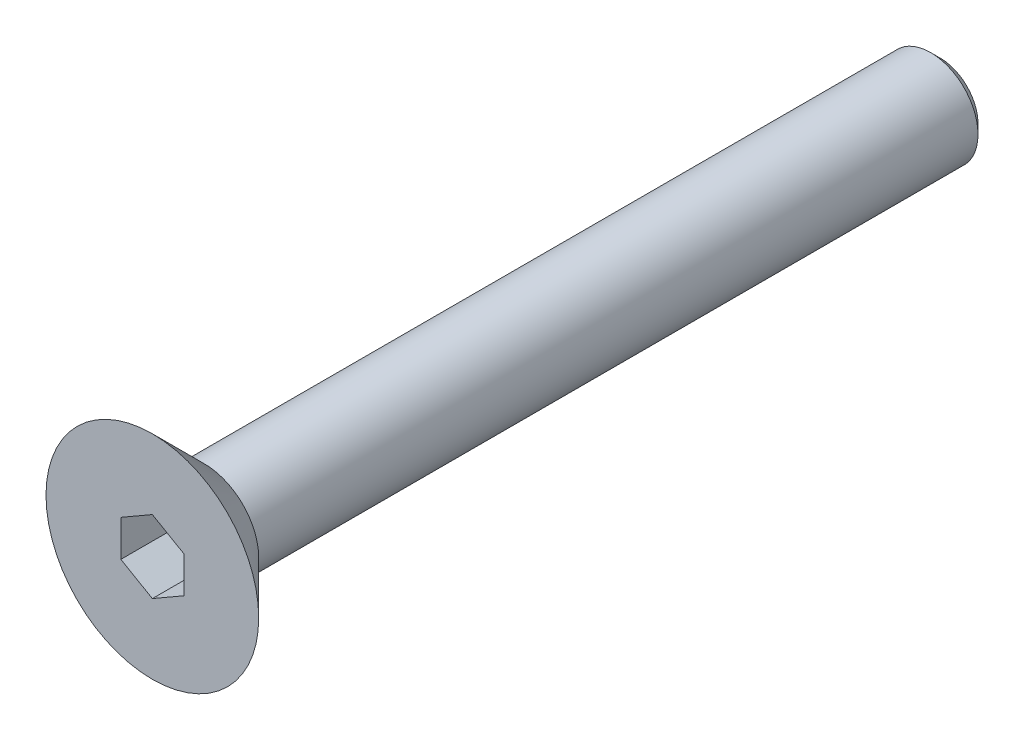
ISO-10303-21;
HEADER;
FILE_DESCRIPTION(('STEP AP214'),'2;1');
FILE_NAME('part.step','',(''),(''),'','','');
FILE_SCHEMA(('AUTOMOTIVE_DESIGN { 1 0 10303 214 1 1 1 1 }'));
ENDSEC;
DATA;
#1=APPLICATION_CONTEXT('core data for automotive mechanical design processes');
#2=APPLICATION_PROTOCOL_DEFINITION('international standard','automotive_design',2000,#1);
#3=PRODUCT_CONTEXT('',#1,'mechanical');
#4=PRODUCT('Part','Part','',(#3));
#5=PRODUCT_RELATED_PRODUCT_CATEGORY('part','',(#4));
#6=PRODUCT_DEFINITION_FORMATION('','',#4);
#7=PRODUCT_DEFINITION_CONTEXT('part definition',#1,'design');
#8=PRODUCT_DEFINITION('design','',#6,#7);
#9=PRODUCT_DEFINITION_SHAPE('','',#8);
#10=(LENGTH_UNIT() NAMED_UNIT(*) SI_UNIT(.MILLI.,.METRE.));
#11=(NAMED_UNIT(*) PLANE_ANGLE_UNIT() SI_UNIT($,.RADIAN.));
#12=(NAMED_UNIT(*) SI_UNIT($,.STERADIAN.) SOLID_ANGLE_UNIT());
#13=UNCERTAINTY_MEASURE_WITH_UNIT(LENGTH_MEASURE(1.E-05),#10,'distance_accuracy_value','');
#14=(GEOMETRIC_REPRESENTATION_CONTEXT(3) GLOBAL_UNCERTAINTY_ASSIGNED_CONTEXT((#13)) GLOBAL_UNIT_ASSIGNED_CONTEXT((#10,
#11,#12)) REPRESENTATION_CONTEXT('',''));
#15=CARTESIAN_POINT('',(0.,0.,0.));
#16=DIRECTION('',(0.,0.,1.));
#17=DIRECTION('',(1.,0.,0.));
#18=AXIS2_PLACEMENT_3D('',#15,#16,#17);
#19=CARTESIAN_POINT('',(0.,0.,0.));
#20=DIRECTION('',(0.,0.,1.));
#21=DIRECTION('',(1.,0.,0.));
#22=AXIS2_PLACEMENT_3D('',#19,#20,#21);
#23=PLANE('',#22);
#24=CARTESIAN_POINT('',(0.,0.,0.));
#25=DIRECTION('',(0.,0.,1.));
#26=DIRECTION('',(1.,0.,0.));
#27=AXIS2_PLACEMENT_3D('',#24,#25,#26);
#28=CIRCLE('',#27,1.725);
#29=CARTESIAN_POINT('',(1.725,0.,0.));
#30=VERTEX_POINT('',#29);
#31=EDGE_CURVE('E11',#30,#30,#28,.F.);
#32=ORIENTED_EDGE('',*,*,#31,.T.);
#33=EDGE_LOOP('',(#32));
#34=FACE_BOUND('',#33,.T.);
#35=CARTESIAN_POINT('',(0.,0.,0.));
#36=DIRECTION('',(0.,0.,1.));
#37=DIRECTION('',(1.,0.,0.));
#38=AXIS2_PLACEMENT_3D('',#35,#36,#37);
#39=CIRCLE('',#38,1.5);
#40=CARTESIAN_POINT('',(1.5,0.,0.));
#41=VERTEX_POINT('',#40);
#42=EDGE_CURVE('E144',#41,#41,#39,.F.);
#43=ORIENTED_EDGE('',*,*,#42,.F.);
#44=EDGE_LOOP('',(#43));
#45=FACE_BOUND('',#44,.T.);
#46=ADVANCED_FACE('F34',(#34,#45),#23,.F.);
#47=CARTESIAN_POINT('',(0.,0.,1.65));
#48=DIRECTION('',(0.,0.,1.));
#49=DIRECTION('',(1.,0.,0.));
#50=AXIS2_PLACEMENT_3D('',#47,#48,#49);
#51=PLANE('',#50);
#52=DIRECTION('',(-0.866025403784439,0.5,0.));
#53=VECTOR('',#52,1.);
#54=CARTESIAN_POINT('',(1.,0.577350269189626,1.65));
#55=LINE('',#54,#53);
#56=CARTESIAN_POINT('',(1.,0.577350269189626,1.65));
#57=VERTEX_POINT('',#56);
#58=CARTESIAN_POINT('',(0.,1.15470053837925,1.65));
#59=VERTEX_POINT('',#58);
#60=EDGE_CURVE('E49',#57,#59,#55,.T.);
#61=ORIENTED_EDGE('',*,*,#60,.F.);
#62=DIRECTION('',(0.,1.,0.));
#63=VECTOR('',#62,1.);
#64=CARTESIAN_POINT('',(1.,-0.577350269189626,1.65));
#65=LINE('',#64,#63);
#66=CARTESIAN_POINT('',(1.,-0.577350269189626,1.65));
#67=VERTEX_POINT('',#66);
#68=EDGE_CURVE('E132',#67,#57,#65,.T.);
#69=ORIENTED_EDGE('',*,*,#68,.F.);
#70=DIRECTION('',(0.866025403784439,0.5,0.));
#71=VECTOR('',#70,1.);
#72=CARTESIAN_POINT('',(0.,-1.15470053837925,1.65));
#73=LINE('',#72,#71);
#74=CARTESIAN_POINT('',(0.,-1.15470053837925,1.65));
#75=VERTEX_POINT('',#74);
#76=EDGE_CURVE('E130',#75,#67,#73,.T.);
#77=ORIENTED_EDGE('',*,*,#76,.F.);
#78=DIRECTION('',(0.866025403784439,-0.5,0.));
#79=VECTOR('',#78,1.);
#80=CARTESIAN_POINT('',(-1.,-0.577350269189626,1.65));
#81=LINE('',#80,#79);
#82=CARTESIAN_POINT('',(-1.,-0.577350269189626,1.65));
#83=VERTEX_POINT('',#82);
#84=EDGE_CURVE('E97',#83,#75,#81,.T.);
#85=ORIENTED_EDGE('',*,*,#84,.F.);
#86=DIRECTION('',(0.,-1.,0.));
#87=VECTOR('',#86,1.);
#88=CARTESIAN_POINT('',(-1.,0.577350269189626,1.65));
#89=LINE('',#88,#87);
#90=CARTESIAN_POINT('',(-1.,0.577350269189626,1.65));
#91=VERTEX_POINT('',#90);
#92=EDGE_CURVE('E126',#91,#83,#89,.T.);
#93=ORIENTED_EDGE('',*,*,#92,.F.);
#94=DIRECTION('',(-0.866025403784439,-0.5,0.));
#95=VECTOR('',#94,1.);
#96=CARTESIAN_POINT('',(0.,1.15470053837925,1.65));
#97=LINE('',#96,#95);
#98=EDGE_CURVE('E123',#59,#91,#97,.T.);
#99=ORIENTED_EDGE('',*,*,#98,.F.);
#100=EDGE_LOOP('',(#61,#69,#77,#85,#93,#99));
#101=FACE_BOUND('',#100,.T.);
#102=CARTESIAN_POINT('',(0.,0.,1.65));
#103=DIRECTION('',(0.,0.,1.));
#104=DIRECTION('',(1.,0.,0.));
#105=AXIS2_PLACEMENT_3D('',#102,#103,#104);
#106=CIRCLE('',#105,3.375);
#107=CARTESIAN_POINT('',(3.375,0.,1.65));
#108=VERTEX_POINT('',#107);
#109=EDGE_CURVE('E136',#108,#108,#106,.T.);
#110=ORIENTED_EDGE('',*,*,#109,.T.);
#111=EDGE_LOOP('',(#110));
#112=FACE_BOUND('',#111,.T.);
#113=ADVANCED_FACE('F167',(#101,#112),#51,.T.);
#114=CARTESIAN_POINT('',(0.,0.,-23.35));
#115=DIRECTION('',(0.,0.,1.));
#116=DIRECTION('',(1.,0.,0.));
#117=AXIS2_PLACEMENT_3D('',#114,#115,#116);
#118=CYLINDRICAL_SURFACE('',#117,1.5);
#119=CARTESIAN_POINT('',(0.,0.,-23.05));
#120=DIRECTION('',(0.,0.,-1.));
#121=DIRECTION('',(-1.,0.,0.));
#122=AXIS2_PLACEMENT_3D('',#119,#120,#121);
#123=CIRCLE('',#122,1.5);
#124=CARTESIAN_POINT('',(-1.5,0.,-23.05));
#125=VERTEX_POINT('',#124);
#126=EDGE_CURVE('E42',#125,#125,#123,.F.);
#127=ORIENTED_EDGE('',*,*,#126,.T.);
#128=EDGE_LOOP('',(#127));
#129=FACE_BOUND('',#128,.T.);
#130=ORIENTED_EDGE('',*,*,#42,.T.);
#131=EDGE_LOOP('',(#130));
#132=FACE_BOUND('',#131,.T.);
#133=ADVANCED_FACE('F152',(#129,#132),#118,.T.);
#134=CARTESIAN_POINT('',(0.,0.,-23.35));
#135=DIRECTION('',(0.,0.,-1.));
#136=DIRECTION('',(-1.,0.,0.));
#137=AXIS2_PLACEMENT_3D('',#134,#135,#136);
#138=PLANE('',#137);
#139=CARTESIAN_POINT('',(0.,0.,-23.35));
#140=DIRECTION('',(0.,0.,-1.));
#141=DIRECTION('',(-1.,0.,0.));
#142=AXIS2_PLACEMENT_3D('',#139,#140,#141);
#143=CIRCLE('',#142,1.2);
#144=CARTESIAN_POINT('',(-1.2,0.,-23.35));
#145=VERTEX_POINT('',#144);
#146=EDGE_CURVE('E147',#145,#145,#143,.T.);
#147=ORIENTED_EDGE('',*,*,#146,.T.);
#148=EDGE_LOOP('',(#147));
#149=FACE_BOUND('',#148,.T.);
#150=ADVANCED_FACE('F159',(#149),#138,.T.);
#151=CARTESIAN_POINT('',(0.,0.,-23.35));
#152=DIRECTION('',(0.,0.,1.));
#153=DIRECTION('',(1.,0.,0.));
#154=AXIS2_PLACEMENT_3D('',#151,#152,#153);
#155=CONICAL_SURFACE('',#154,1.2,0.785398163397452);
#156=ORIENTED_EDGE('',*,*,#126,.F.);
#157=EDGE_LOOP('',(#156));
#158=FACE_BOUND('',#157,.T.);
#159=ORIENTED_EDGE('',*,*,#146,.F.);
#160=EDGE_LOOP('',(#159));
#161=FACE_BOUND('',#160,.T.);
#162=ADVANCED_FACE('F155',(#158,#161),#155,.T.);
#163=CARTESIAN_POINT('',(1.,0.577350269189626,-0.35));
#164=DIRECTION('',(0.5,0.866025403784439,0.));
#165=DIRECTION('',(-0.866025403784439,0.5,0.));
#166=AXIS2_PLACEMENT_3D('',#163,#164,#165);
#167=PLANE('',#166);
#168=ORIENTED_EDGE('',*,*,#60,.T.);
#169=DIRECTION('',(0.,0.,1.));
#170=VECTOR('',#169,1.);
#171=CARTESIAN_POINT('',(0.,1.15470053837925,-0.35));
#172=LINE('',#171,#170);
#173=CARTESIAN_POINT('',(0.,1.15470053837925,-0.35));
#174=VERTEX_POINT('',#173);
#175=EDGE_CURVE('E79',#174,#59,#172,.T.);
#176=ORIENTED_EDGE('',*,*,#175,.F.);
#177=DIRECTION('',(-0.866025403784439,0.5,0.));
#178=VECTOR('',#177,1.);
#179=CARTESIAN_POINT('',(1.,0.577350269189626,-0.35));
#180=LINE('',#179,#178);
#181=CARTESIAN_POINT('',(1.,0.577350269189626,-0.35));
#182=VERTEX_POINT('',#181);
#183=EDGE_CURVE('E134',#182,#174,#180,.T.);
#184=ORIENTED_EDGE('',*,*,#183,.F.);
#185=DIRECTION('',(0.,0.,1.));
#186=VECTOR('',#185,1.);
#187=CARTESIAN_POINT('',(1.,0.577350269189626,-0.35));
#188=LINE('',#187,#186);
#189=EDGE_CURVE('E57',#182,#57,#188,.T.);
#190=ORIENTED_EDGE('',*,*,#189,.T.);
#191=EDGE_LOOP('',(#168,#176,#184,#190));
#192=FACE_BOUND('',#191,.T.);
#193=ADVANCED_FACE('F158',(#192),#167,.F.);
#194=CARTESIAN_POINT('',(1.,-0.577350269189626,-0.35));
#195=DIRECTION('',(1.,0.,0.));
#196=DIRECTION('',(0.,1.,0.));
#197=AXIS2_PLACEMENT_3D('',#194,#195,#196);
#198=PLANE('',#197);
#199=ORIENTED_EDGE('',*,*,#68,.T.);
#200=ORIENTED_EDGE('',*,*,#189,.F.);
#201=DIRECTION('',(0.,1.,0.));
#202=VECTOR('',#201,1.);
#203=CARTESIAN_POINT('',(1.,-0.577350269189626,-0.35));
#204=LINE('',#203,#202);
#205=CARTESIAN_POINT('',(1.,-0.577350269189626,-0.35));
#206=VERTEX_POINT('',#205);
#207=EDGE_CURVE('E109',#206,#182,#204,.T.);
#208=ORIENTED_EDGE('',*,*,#207,.F.);
#209=DIRECTION('',(0.,0.,1.));
#210=VECTOR('',#209,1.);
#211=CARTESIAN_POINT('',(1.,-0.577350269189626,-0.35));
#212=LINE('',#211,#210);
#213=EDGE_CURVE('E101',#206,#67,#212,.T.);
#214=ORIENTED_EDGE('',*,*,#213,.T.);
#215=EDGE_LOOP('',(#199,#200,#208,#214));
#216=FACE_BOUND('',#215,.T.);
#217=ADVANCED_FACE('F198',(#216),#198,.F.);
#218=CARTESIAN_POINT('',(0.,-1.15470053837925,-0.35));
#219=DIRECTION('',(0.5,-0.866025403784439,0.));
#220=DIRECTION('',(0.866025403784439,0.5,0.));
#221=AXIS2_PLACEMENT_3D('',#218,#219,#220);
#222=PLANE('',#221);
#223=ORIENTED_EDGE('',*,*,#76,.T.);
#224=ORIENTED_EDGE('',*,*,#213,.F.);
#225=DIRECTION('',(0.866025403784439,0.5,0.));
#226=VECTOR('',#225,1.);
#227=CARTESIAN_POINT('',(0.,-1.15470053837925,-0.35));
#228=LINE('',#227,#226);
#229=CARTESIAN_POINT('',(0.,-1.15470053837925,-0.35));
#230=VERTEX_POINT('',#229);
#231=EDGE_CURVE('E105',#230,#206,#228,.T.);
#232=ORIENTED_EDGE('',*,*,#231,.F.);
#233=DIRECTION('',(0.,0.,1.));
#234=VECTOR('',#233,1.);
#235=CARTESIAN_POINT('',(0.,-1.15470053837925,-0.35));
#236=LINE('',#235,#234);
#237=EDGE_CURVE('E90',#230,#75,#236,.T.);
#238=ORIENTED_EDGE('',*,*,#237,.T.);
#239=EDGE_LOOP('',(#223,#224,#232,#238));
#240=FACE_BOUND('',#239,.T.);
#241=ADVANCED_FACE('F106',(#240),#222,.F.);
#242=CARTESIAN_POINT('',(-1.,-0.577350269189626,-0.35));
#243=DIRECTION('',(-0.5,-0.866025403784439,0.));
#244=DIRECTION('',(0.866025403784439,-0.5,0.));
#245=AXIS2_PLACEMENT_3D('',#242,#243,#244);
#246=PLANE('',#245);
#247=ORIENTED_EDGE('',*,*,#84,.T.);
#248=ORIENTED_EDGE('',*,*,#237,.F.);
#249=DIRECTION('',(0.866025403784439,-0.5,0.));
#250=VECTOR('',#249,1.);
#251=CARTESIAN_POINT('',(-1.,-0.577350269189626,-0.35));
#252=LINE('',#251,#250);
#253=CARTESIAN_POINT('',(-1.,-0.577350269189626,-0.35));
#254=VERTEX_POINT('',#253);
#255=EDGE_CURVE('E94',#254,#230,#252,.T.);
#256=ORIENTED_EDGE('',*,*,#255,.F.);
#257=DIRECTION('',(0.,0.,1.));
#258=VECTOR('',#257,1.);
#259=CARTESIAN_POINT('',(-1.,-0.577350269189626,-0.35));
#260=LINE('',#259,#258);
#261=EDGE_CURVE('E102',#254,#83,#260,.T.);
#262=ORIENTED_EDGE('',*,*,#261,.T.);
#263=EDGE_LOOP('',(#247,#248,#256,#262));
#264=FACE_BOUND('',#263,.T.);
#265=ADVANCED_FACE('F92',(#264),#246,.F.);
#266=CARTESIAN_POINT('',(-1.,0.577350269189626,-0.35));
#267=DIRECTION('',(-1.,0.,0.));
#268=DIRECTION('',(0.,-1.,0.));
#269=AXIS2_PLACEMENT_3D('',#266,#267,#268);
#270=PLANE('',#269);
#271=ORIENTED_EDGE('',*,*,#92,.T.);
#272=ORIENTED_EDGE('',*,*,#261,.F.);
#273=DIRECTION('',(0.,-1.,0.));
#274=VECTOR('',#273,1.);
#275=CARTESIAN_POINT('',(-1.,0.577350269189626,-0.35));
#276=LINE('',#275,#274);
#277=CARTESIAN_POINT('',(-1.,0.577350269189626,-0.35));
#278=VERTEX_POINT('',#277);
#279=EDGE_CURVE('E115',#278,#254,#276,.T.);
#280=ORIENTED_EDGE('',*,*,#279,.F.);
#281=DIRECTION('',(0.,0.,1.));
#282=VECTOR('',#281,1.);
#283=CARTESIAN_POINT('',(-1.,0.577350269189626,-0.35));
#284=LINE('',#283,#282);
#285=EDGE_CURVE('E139',#278,#91,#284,.T.);
#286=ORIENTED_EDGE('',*,*,#285,.T.);
#287=EDGE_LOOP('',(#271,#272,#280,#286));
#288=FACE_BOUND('',#287,.T.);
#289=ADVANCED_FACE('F194',(#288),#270,.F.);
#290=CARTESIAN_POINT('',(0.,1.15470053837925,-0.35));
#291=DIRECTION('',(-0.5,0.866025403784439,0.));
#292=DIRECTION('',(-0.866025403784439,-0.5,0.));
#293=AXIS2_PLACEMENT_3D('',#290,#291,#292);
#294=PLANE('',#293);
#295=ORIENTED_EDGE('',*,*,#98,.T.);
#296=ORIENTED_EDGE('',*,*,#285,.F.);
#297=DIRECTION('',(-0.866025403784439,-0.5,0.));
#298=VECTOR('',#297,1.);
#299=CARTESIAN_POINT('',(0.,1.15470053837925,-0.35));
#300=LINE('',#299,#298);
#301=EDGE_CURVE('E117',#174,#278,#300,.T.);
#302=ORIENTED_EDGE('',*,*,#301,.F.);
#303=ORIENTED_EDGE('',*,*,#175,.T.);
#304=EDGE_LOOP('',(#295,#296,#302,#303));
#305=FACE_BOUND('',#304,.T.);
#306=ADVANCED_FACE('F189',(#305),#294,.F.);
#307=CARTESIAN_POINT('',(0.,0.,-0.35));
#308=DIRECTION('',(0.,0.,1.));
#309=DIRECTION('',(1.,0.,0.));
#310=AXIS2_PLACEMENT_3D('',#307,#308,#309);
#311=PLANE('',#310);
#312=ORIENTED_EDGE('',*,*,#183,.T.);
#313=ORIENTED_EDGE('',*,*,#301,.T.);
#314=ORIENTED_EDGE('',*,*,#279,.T.);
#315=ORIENTED_EDGE('',*,*,#255,.T.);
#316=ORIENTED_EDGE('',*,*,#231,.T.);
#317=ORIENTED_EDGE('',*,*,#207,.T.);
#318=EDGE_LOOP('',(#312,#313,#314,#315,#316,#317));
#319=FACE_BOUND('',#318,.T.);
#320=ADVANCED_FACE('F112',(#319),#311,.T.);
#321=CARTESIAN_POINT('',(0.,0.,1.65));
#322=DIRECTION('',(0.,0.,1.));
#323=DIRECTION('',(1.,0.,0.));
#324=AXIS2_PLACEMENT_3D('',#321,#322,#323);
#325=CONICAL_SURFACE('',#324,3.375,0.78539816339745);
#326=ORIENTED_EDGE('',*,*,#31,.F.);
#327=EDGE_LOOP('',(#326));
#328=FACE_BOUND('',#327,.T.);
#329=ORIENTED_EDGE('',*,*,#109,.F.);
#330=EDGE_LOOP('',(#329));
#331=FACE_BOUND('',#330,.T.);
#332=ADVANCED_FACE('F36',(#328,#331),#325,.T.);
#333=CLOSED_SHELL('',(#46,#113,#133,#150,#162,#193,#217,#241,#265,#289,#306,#320,#332));
#334=MANIFOLD_SOLID_BREP('B2',#333);
#335=ADVANCED_BREP_SHAPE_REPRESENTATION('',(#18,#334),#14);
#336=SHAPE_DEFINITION_REPRESENTATION(#9,#335);
ENDSEC;
END-ISO-10303-21;
